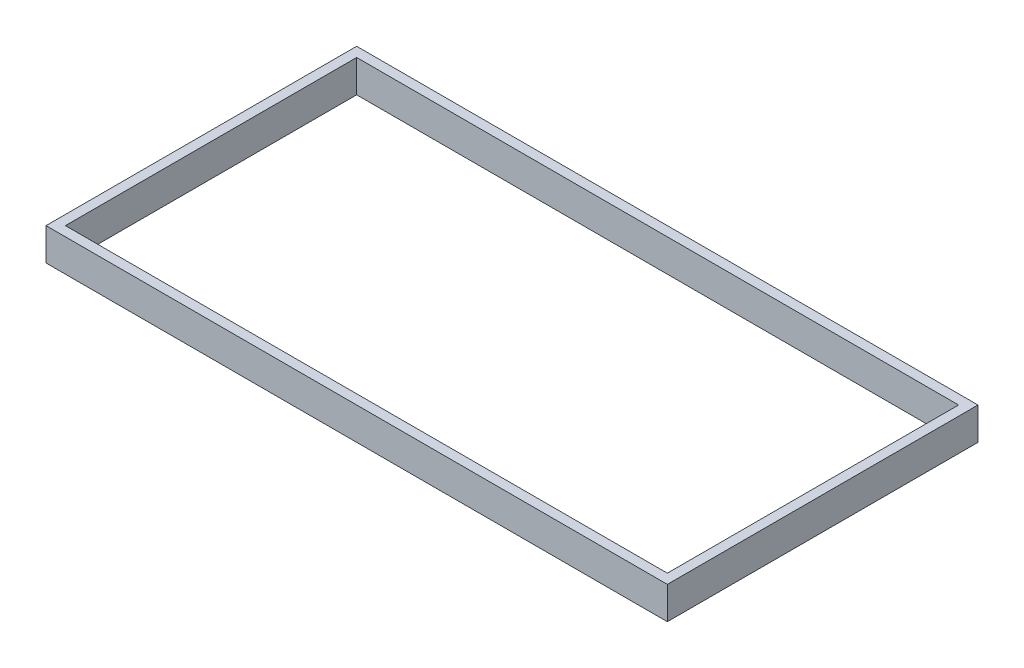
ISO-10303-21;
HEADER;
FILE_DESCRIPTION(('STEP AP214'),'2;1');
FILE_NAME('part.step','',(''),(''),'','','');
FILE_SCHEMA(('AUTOMOTIVE_DESIGN { 1 0 10303 214 1 1 1 1 }'));
ENDSEC;
DATA;
#1=APPLICATION_CONTEXT('core data for automotive mechanical design processes');
#2=APPLICATION_PROTOCOL_DEFINITION('international standard','automotive_design',2000,#1);
#3=PRODUCT_CONTEXT('',#1,'mechanical');
#4=PRODUCT('Part','Part','',(#3));
#5=PRODUCT_RELATED_PRODUCT_CATEGORY('part','',(#4));
#6=PRODUCT_DEFINITION_FORMATION('','',#4);
#7=PRODUCT_DEFINITION_CONTEXT('part definition',#1,'design');
#8=PRODUCT_DEFINITION('design','',#6,#7);
#9=PRODUCT_DEFINITION_SHAPE('','',#8);
#10=(LENGTH_UNIT() NAMED_UNIT(*) SI_UNIT(.MILLI.,.METRE.));
#11=(NAMED_UNIT(*) PLANE_ANGLE_UNIT() SI_UNIT($,.RADIAN.));
#12=(NAMED_UNIT(*) SI_UNIT($,.STERADIAN.) SOLID_ANGLE_UNIT());
#13=UNCERTAINTY_MEASURE_WITH_UNIT(LENGTH_MEASURE(1.E-05),#10,'distance_accuracy_value','');
#14=(GEOMETRIC_REPRESENTATION_CONTEXT(3) GLOBAL_UNCERTAINTY_ASSIGNED_CONTEXT((#13)) GLOBAL_UNIT_ASSIGNED_CONTEXT((#10,
#11,#12)) REPRESENTATION_CONTEXT('',''));
#15=CARTESIAN_POINT('',(0.,0.,0.));
#16=DIRECTION('',(0.,0.,1.));
#17=DIRECTION('',(1.,0.,0.));
#18=AXIS2_PLACEMENT_3D('',#15,#16,#17);
#19=CARTESIAN_POINT('',(0.,63.5,0.));
#20=DIRECTION('',(0.,-1.,0.));
#21=DIRECTION('',(0.,0.,-1.));
#22=AXIS2_PLACEMENT_3D('',#19,#20,#21);
#23=PLANE('',#22);
#24=DIRECTION('',(0.,0.,-1.));
#25=VECTOR('',#24,1.);
#26=CARTESIAN_POINT('',(609.6,63.5,304.8));
#27=LINE('',#26,#25);
#28=CARTESIAN_POINT('',(609.6,63.5,304.8));
#29=VERTEX_POINT('',#28);
#30=CARTESIAN_POINT('',(609.6,63.5,-304.8));
#31=VERTEX_POINT('',#30);
#32=EDGE_CURVE('E133',#29,#31,#27,.T.);
#33=ORIENTED_EDGE('',*,*,#32,.T.);
#34=DIRECTION('',(-1.,0.,0.));
#35=VECTOR('',#34,1.);
#36=CARTESIAN_POINT('',(-609.6,63.5,-304.8));
#37=LINE('',#36,#35);
#38=CARTESIAN_POINT('',(-609.6,63.5,-304.8));
#39=VERTEX_POINT('',#38);
#40=EDGE_CURVE('E136',#31,#39,#37,.T.);
#41=ORIENTED_EDGE('',*,*,#40,.T.);
#42=DIRECTION('',(0.,0.,1.));
#43=VECTOR('',#42,1.);
#44=CARTESIAN_POINT('',(-609.6,63.5,304.8));
#45=LINE('',#44,#43);
#46=CARTESIAN_POINT('',(-609.6,63.5,304.8));
#47=VERTEX_POINT('',#46);
#48=EDGE_CURVE('E139',#39,#47,#45,.T.);
#49=ORIENTED_EDGE('',*,*,#48,.T.);
#50=DIRECTION('',(1.,0.,0.));
#51=VECTOR('',#50,1.);
#52=CARTESIAN_POINT('',(-609.6,63.5,304.8));
#53=LINE('',#52,#51);
#54=EDGE_CURVE('E141',#47,#29,#53,.T.);
#55=ORIENTED_EDGE('',*,*,#54,.T.);
#56=EDGE_LOOP('',(#33,#41,#49,#55));
#57=FACE_BOUND('',#56,.T.);
#58=DIRECTION('',(0.,0.,-1.));
#59=VECTOR('',#58,1.);
#60=CARTESIAN_POINT('',(590.55,63.5,285.75));
#61=LINE('',#60,#59);
#62=CARTESIAN_POINT('',(590.55,63.5,285.75));
#63=VERTEX_POINT('',#62);
#64=CARTESIAN_POINT('',(590.55,63.5,-285.75));
#65=VERTEX_POINT('',#64);
#66=EDGE_CURVE('E97',#63,#65,#61,.T.);
#67=ORIENTED_EDGE('',*,*,#66,.F.);
#68=DIRECTION('',(1.,0.,0.));
#69=VECTOR('',#68,1.);
#70=CARTESIAN_POINT('',(-590.55,63.5,285.75));
#71=LINE('',#70,#69);
#72=CARTESIAN_POINT('',(-590.55,63.5,285.75));
#73=VERTEX_POINT('',#72);
#74=EDGE_CURVE('E119',#73,#63,#71,.T.);
#75=ORIENTED_EDGE('',*,*,#74,.F.);
#76=DIRECTION('',(0.,0.,1.));
#77=VECTOR('',#76,1.);
#78=CARTESIAN_POINT('',(-590.55,63.5,285.75));
#79=LINE('',#78,#77);
#80=CARTESIAN_POINT('',(-590.55,63.5,-285.75));
#81=VERTEX_POINT('',#80);
#82=EDGE_CURVE('E117',#81,#73,#79,.T.);
#83=ORIENTED_EDGE('',*,*,#82,.F.);
#84=DIRECTION('',(-1.,0.,0.));
#85=VECTOR('',#84,1.);
#86=CARTESIAN_POINT('',(-590.55,63.5,-285.75));
#87=LINE('',#86,#85);
#88=EDGE_CURVE('E105',#65,#81,#87,.T.);
#89=ORIENTED_EDGE('',*,*,#88,.F.);
#90=EDGE_LOOP('',(#67,#75,#83,#89));
#91=FACE_BOUND('',#90,.T.);
#92=ADVANCED_FACE('F32',(#57,#91),#23,.F.);
#93=CARTESIAN_POINT('',(0.,0.,0.));
#94=DIRECTION('',(0.,-1.,0.));
#95=DIRECTION('',(0.,0.,-1.));
#96=AXIS2_PLACEMENT_3D('',#93,#94,#95);
#97=PLANE('',#96);
#98=DIRECTION('',(0.,0.,-1.));
#99=VECTOR('',#98,1.);
#100=CARTESIAN_POINT('',(609.6,0.,304.8));
#101=LINE('',#100,#99);
#102=CARTESIAN_POINT('',(609.6,0.,304.8));
#103=VERTEX_POINT('',#102);
#104=CARTESIAN_POINT('',(609.6,0.,-304.8));
#105=VERTEX_POINT('',#104);
#106=EDGE_CURVE('E113',#103,#105,#101,.T.);
#107=ORIENTED_EDGE('',*,*,#106,.F.);
#108=DIRECTION('',(1.,0.,0.));
#109=VECTOR('',#108,1.);
#110=CARTESIAN_POINT('',(-609.6,0.,304.8));
#111=LINE('',#110,#109);
#112=CARTESIAN_POINT('',(-609.6,0.,304.8));
#113=VERTEX_POINT('',#112);
#114=EDGE_CURVE('E137',#113,#103,#111,.T.);
#115=ORIENTED_EDGE('',*,*,#114,.F.);
#116=DIRECTION('',(0.,0.,1.));
#117=VECTOR('',#116,1.);
#118=CARTESIAN_POINT('',(-609.6,0.,304.8));
#119=LINE('',#118,#117);
#120=CARTESIAN_POINT('',(-609.6,0.,-304.8));
#121=VERTEX_POINT('',#120);
#122=EDGE_CURVE('E148',#121,#113,#119,.T.);
#123=ORIENTED_EDGE('',*,*,#122,.F.);
#124=DIRECTION('',(-1.,0.,0.));
#125=VECTOR('',#124,1.);
#126=CARTESIAN_POINT('',(-609.6,0.,-304.8));
#127=LINE('',#126,#125);
#128=EDGE_CURVE('E146',#105,#121,#127,.T.);
#129=ORIENTED_EDGE('',*,*,#128,.F.);
#130=EDGE_LOOP('',(#107,#115,#123,#129));
#131=FACE_BOUND('',#130,.T.);
#132=DIRECTION('',(1.,0.,0.));
#133=VECTOR('',#132,1.);
#134=CARTESIAN_POINT('',(-590.55,0.,285.75));
#135=LINE('',#134,#133);
#136=CARTESIAN_POINT('',(-590.55,0.,285.75));
#137=VERTEX_POINT('',#136);
#138=CARTESIAN_POINT('',(590.55,0.,285.75));
#139=VERTEX_POINT('',#138);
#140=EDGE_CURVE('E106',#137,#139,#135,.T.);
#141=ORIENTED_EDGE('',*,*,#140,.T.);
#142=DIRECTION('',(0.,0.,-1.));
#143=VECTOR('',#142,1.);
#144=CARTESIAN_POINT('',(590.55,0.,285.75));
#145=LINE('',#144,#143);
#146=CARTESIAN_POINT('',(590.55,0.,-285.75));
#147=VERTEX_POINT('',#146);
#148=EDGE_CURVE('E55',#139,#147,#145,.T.);
#149=ORIENTED_EDGE('',*,*,#148,.T.);
#150=DIRECTION('',(-1.,0.,0.));
#151=VECTOR('',#150,1.);
#152=CARTESIAN_POINT('',(-590.55,0.,-285.75));
#153=LINE('',#152,#151);
#154=CARTESIAN_POINT('',(-590.55,0.,-285.75));
#155=VERTEX_POINT('',#154);
#156=EDGE_CURVE('E112',#147,#155,#153,.T.);
#157=ORIENTED_EDGE('',*,*,#156,.T.);
#158=DIRECTION('',(0.,0.,1.));
#159=VECTOR('',#158,1.);
#160=CARTESIAN_POINT('',(-590.55,0.,285.75));
#161=LINE('',#160,#159);
#162=EDGE_CURVE('E125',#155,#137,#161,.T.);
#163=ORIENTED_EDGE('',*,*,#162,.T.);
#164=EDGE_LOOP('',(#141,#149,#157,#163));
#165=FACE_BOUND('',#164,.T.);
#166=ADVANCED_FACE('F166',(#131,#165),#97,.T.);
#167=CARTESIAN_POINT('',(609.6,63.5,304.8));
#168=DIRECTION('',(-1.,0.,0.));
#169=DIRECTION('',(0.,0.,1.));
#170=AXIS2_PLACEMENT_3D('',#167,#168,#169);
#171=PLANE('',#170);
#172=ORIENTED_EDGE('',*,*,#106,.T.);
#173=DIRECTION('',(0.,-1.,0.));
#174=VECTOR('',#173,1.);
#175=CARTESIAN_POINT('',(609.6,63.5,-304.8));
#176=LINE('',#175,#174);
#177=EDGE_CURVE('E11',#31,#105,#176,.T.);
#178=ORIENTED_EDGE('',*,*,#177,.F.);
#179=ORIENTED_EDGE('',*,*,#32,.F.);
#180=DIRECTION('',(0.,-1.,0.));
#181=VECTOR('',#180,1.);
#182=CARTESIAN_POINT('',(609.6,63.5,304.8));
#183=LINE('',#182,#181);
#184=EDGE_CURVE('E143',#29,#103,#183,.T.);
#185=ORIENTED_EDGE('',*,*,#184,.T.);
#186=EDGE_LOOP('',(#172,#178,#179,#185));
#187=FACE_BOUND('',#186,.T.);
#188=ADVANCED_FACE('F34',(#187),#171,.F.);
#189=CARTESIAN_POINT('',(-609.6,63.5,-304.8));
#190=DIRECTION('',(0.,0.,1.));
#191=DIRECTION('',(1.,0.,0.));
#192=AXIS2_PLACEMENT_3D('',#189,#190,#191);
#193=PLANE('',#192);
#194=ORIENTED_EDGE('',*,*,#128,.T.);
#195=DIRECTION('',(0.,-1.,0.));
#196=VECTOR('',#195,1.);
#197=CARTESIAN_POINT('',(-609.6,63.5,-304.8));
#198=LINE('',#197,#196);
#199=EDGE_CURVE('E40',#39,#121,#198,.T.);
#200=ORIENTED_EDGE('',*,*,#199,.F.);
#201=ORIENTED_EDGE('',*,*,#40,.F.);
#202=ORIENTED_EDGE('',*,*,#177,.T.);
#203=EDGE_LOOP('',(#194,#200,#201,#202));
#204=FACE_BOUND('',#203,.T.);
#205=ADVANCED_FACE('F176',(#204),#193,.F.);
#206=CARTESIAN_POINT('',(-609.6,63.5,304.8));
#207=DIRECTION('',(1.,0.,0.));
#208=DIRECTION('',(0.,0.,-1.));
#209=AXIS2_PLACEMENT_3D('',#206,#207,#208);
#210=PLANE('',#209);
#211=ORIENTED_EDGE('',*,*,#122,.T.);
#212=DIRECTION('',(0.,-1.,0.));
#213=VECTOR('',#212,1.);
#214=CARTESIAN_POINT('',(-609.6,63.5,304.8));
#215=LINE('',#214,#213);
#216=EDGE_CURVE('E153',#47,#113,#215,.T.);
#217=ORIENTED_EDGE('',*,*,#216,.F.);
#218=ORIENTED_EDGE('',*,*,#48,.F.);
#219=ORIENTED_EDGE('',*,*,#199,.T.);
#220=EDGE_LOOP('',(#211,#217,#218,#219));
#221=FACE_BOUND('',#220,.T.);
#222=ADVANCED_FACE('F160',(#221),#210,.F.);
#223=CARTESIAN_POINT('',(-609.6,63.5,304.8));
#224=DIRECTION('',(0.,0.,-1.));
#225=DIRECTION('',(-1.,0.,0.));
#226=AXIS2_PLACEMENT_3D('',#223,#224,#225);
#227=PLANE('',#226);
#228=ORIENTED_EDGE('',*,*,#114,.T.);
#229=ORIENTED_EDGE('',*,*,#184,.F.);
#230=ORIENTED_EDGE('',*,*,#54,.F.);
#231=ORIENTED_EDGE('',*,*,#216,.T.);
#232=EDGE_LOOP('',(#228,#229,#230,#231));
#233=FACE_BOUND('',#232,.T.);
#234=ADVANCED_FACE('F170',(#233),#227,.F.);
#235=CARTESIAN_POINT('',(590.55,63.5,285.75));
#236=DIRECTION('',(-1.,0.,0.));
#237=DIRECTION('',(0.,0.,1.));
#238=AXIS2_PLACEMENT_3D('',#235,#236,#237);
#239=PLANE('',#238);
#240=ORIENTED_EDGE('',*,*,#148,.F.);
#241=DIRECTION('',(0.,-1.,0.));
#242=VECTOR('',#241,1.);
#243=CARTESIAN_POINT('',(590.55,63.5,285.75));
#244=LINE('',#243,#242);
#245=EDGE_CURVE('E101',#63,#139,#244,.T.);
#246=ORIENTED_EDGE('',*,*,#245,.F.);
#247=ORIENTED_EDGE('',*,*,#66,.T.);
#248=DIRECTION('',(0.,-1.,0.));
#249=VECTOR('',#248,1.);
#250=CARTESIAN_POINT('',(590.55,63.5,-285.75));
#251=LINE('',#250,#249);
#252=EDGE_CURVE('E100',#65,#147,#251,.T.);
#253=ORIENTED_EDGE('',*,*,#252,.T.);
#254=EDGE_LOOP('',(#240,#246,#247,#253));
#255=FACE_BOUND('',#254,.T.);
#256=ADVANCED_FACE('F99',(#255),#239,.T.);
#257=CARTESIAN_POINT('',(-590.55,63.5,-285.75));
#258=DIRECTION('',(0.,0.,1.));
#259=DIRECTION('',(1.,0.,0.));
#260=AXIS2_PLACEMENT_3D('',#257,#258,#259);
#261=PLANE('',#260);
#262=ORIENTED_EDGE('',*,*,#156,.F.);
#263=ORIENTED_EDGE('',*,*,#252,.F.);
#264=ORIENTED_EDGE('',*,*,#88,.T.);
#265=DIRECTION('',(0.,-1.,0.));
#266=VECTOR('',#265,1.);
#267=CARTESIAN_POINT('',(-590.55,63.5,-285.75));
#268=LINE('',#267,#266);
#269=EDGE_CURVE('E114',#81,#155,#268,.T.);
#270=ORIENTED_EDGE('',*,*,#269,.T.);
#271=EDGE_LOOP('',(#262,#263,#264,#270));
#272=FACE_BOUND('',#271,.T.);
#273=ADVANCED_FACE('F109',(#272),#261,.T.);
#274=CARTESIAN_POINT('',(-590.55,63.5,285.75));
#275=DIRECTION('',(1.,0.,0.));
#276=DIRECTION('',(0.,0.,-1.));
#277=AXIS2_PLACEMENT_3D('',#274,#275,#276);
#278=PLANE('',#277);
#279=ORIENTED_EDGE('',*,*,#162,.F.);
#280=ORIENTED_EDGE('',*,*,#269,.F.);
#281=ORIENTED_EDGE('',*,*,#82,.T.);
#282=DIRECTION('',(0.,-1.,0.));
#283=VECTOR('',#282,1.);
#284=CARTESIAN_POINT('',(-590.55,63.5,285.75));
#285=LINE('',#284,#283);
#286=EDGE_CURVE('E47',#73,#137,#285,.T.);
#287=ORIENTED_EDGE('',*,*,#286,.T.);
#288=EDGE_LOOP('',(#279,#280,#281,#287));
#289=FACE_BOUND('',#288,.T.);
#290=ADVANCED_FACE('F199',(#289),#278,.T.);
#291=CARTESIAN_POINT('',(-590.55,63.5,285.75));
#292=DIRECTION('',(0.,0.,-1.));
#293=DIRECTION('',(-1.,0.,0.));
#294=AXIS2_PLACEMENT_3D('',#291,#292,#293);
#295=PLANE('',#294);
#296=ORIENTED_EDGE('',*,*,#140,.F.);
#297=ORIENTED_EDGE('',*,*,#286,.F.);
#298=ORIENTED_EDGE('',*,*,#74,.T.);
#299=ORIENTED_EDGE('',*,*,#245,.T.);
#300=EDGE_LOOP('',(#296,#297,#298,#299));
#301=FACE_BOUND('',#300,.T.);
#302=ADVANCED_FACE('F203',(#301),#295,.T.);
#303=CLOSED_SHELL('',(#92,#166,#188,#205,#222,#234,#256,#273,#290,#302));
#304=MANIFOLD_SOLID_BREP('B2',#303);
#305=ADVANCED_BREP_SHAPE_REPRESENTATION('',(#18,#304),#14);
#306=SHAPE_DEFINITION_REPRESENTATION(#9,#305);
ENDSEC;
END-ISO-10303-21;
